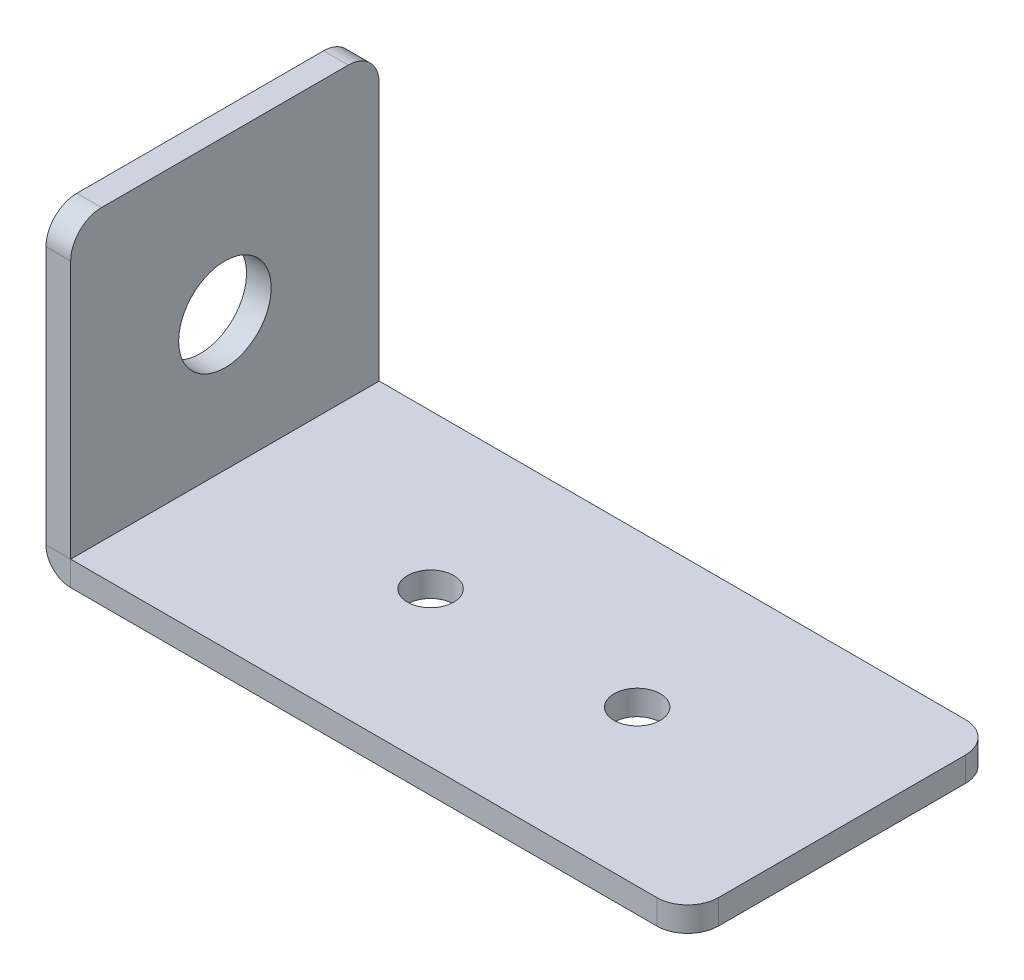
ISO-10303-21;
HEADER;
FILE_DESCRIPTION(('STEP AP214'),'2;1');
FILE_NAME('part.step','',(''),(''),'','','');
FILE_SCHEMA(('AUTOMOTIVE_DESIGN { 1 0 10303 214 1 1 1 1 }'));
ENDSEC;
DATA;
#1=APPLICATION_CONTEXT('core data for automotive mechanical design processes');
#2=APPLICATION_PROTOCOL_DEFINITION('international standard','automotive_design',2000,#1);
#3=PRODUCT_CONTEXT('',#1,'mechanical');
#4=PRODUCT('Part','Part','',(#3));
#5=PRODUCT_RELATED_PRODUCT_CATEGORY('part','',(#4));
#6=PRODUCT_DEFINITION_FORMATION('','',#4);
#7=PRODUCT_DEFINITION_CONTEXT('part definition',#1,'design');
#8=PRODUCT_DEFINITION('design','',#6,#7);
#9=PRODUCT_DEFINITION_SHAPE('','',#8);
#10=(LENGTH_UNIT() NAMED_UNIT(*) SI_UNIT(.MILLI.,.METRE.));
#11=(NAMED_UNIT(*) PLANE_ANGLE_UNIT() SI_UNIT($,.RADIAN.));
#12=(NAMED_UNIT(*) SI_UNIT($,.STERADIAN.) SOLID_ANGLE_UNIT());
#13=UNCERTAINTY_MEASURE_WITH_UNIT(LENGTH_MEASURE(1.E-05),#10,'distance_accuracy_value','');
#14=(GEOMETRIC_REPRESENTATION_CONTEXT(3) GLOBAL_UNCERTAINTY_ASSIGNED_CONTEXT((#13)) GLOBAL_UNIT_ASSIGNED_CONTEXT((#10,
#11,#12)) REPRESENTATION_CONTEXT('',''));
#15=CARTESIAN_POINT('',(0.,0.,0.));
#16=DIRECTION('',(0.,0.,1.));
#17=DIRECTION('',(1.,0.,0.));
#18=AXIS2_PLACEMENT_3D('',#15,#16,#17);
#19=CARTESIAN_POINT('',(-11.6009999999999,16.7427921422373,10.));
#20=DIRECTION('',(0.,0.,1.));
#21=DIRECTION('',(0.,-1.,0.));
#22=AXIS2_PLACEMENT_3D('',#19,#20,#21);
#23=PLANE('',#22);
#24=DIRECTION('',(0.,-1.,0.));
#25=VECTOR('',#24,1.);
#26=CARTESIAN_POINT('',(-11.6009999999999,16.7427921422373,10.));
#27=LINE('',#26,#25);
#28=CARTESIAN_POINT('',(-11.6009999999999,16.7427921422373,10.));
#29=VERTEX_POINT('',#28);
#30=CARTESIAN_POINT('',(-11.601,0.0010000000000062,10.));
#31=VERTEX_POINT('',#30);
#32=EDGE_CURVE('E244',#29,#31,#27,.T.);
#33=ORIENTED_EDGE('',*,*,#32,.T.);
#34=DIRECTION('',(1.,0.,0.));
#35=VECTOR('',#34,1.);
#36=CARTESIAN_POINT('',(-11.601,0.0010000000000062,10.));
#37=LINE('',#36,#35);
#38=CARTESIAN_POINT('',(-10.001,0.001000000000001,10.));
#39=VERTEX_POINT('',#38);
#40=EDGE_CURVE('E12',#31,#39,#37,.T.);
#41=ORIENTED_EDGE('',*,*,#40,.T.);
#42=DIRECTION('',(0.,-1.,0.));
#43=VECTOR('',#42,1.);
#44=CARTESIAN_POINT('',(-10.0009999999999,16.7427921422373,10.));
#45=LINE('',#44,#43);
#46=CARTESIAN_POINT('',(-10.0009999999999,16.7427921422373,10.));
#47=VERTEX_POINT('',#46);
#48=EDGE_CURVE('E60',#47,#39,#45,.T.);
#49=ORIENTED_EDGE('',*,*,#48,.F.);
#50=DIRECTION('',(1.,0.,0.));
#51=VECTOR('',#50,1.);
#52=CARTESIAN_POINT('',(-11.6009999999999,16.7427921422373,10.));
#53=LINE('',#52,#51);
#54=EDGE_CURVE('E160',#29,#47,#53,.T.);
#55=ORIENTED_EDGE('',*,*,#54,.F.);
#56=EDGE_LOOP('',(#33,#41,#49,#55));
#57=FACE_BOUND('',#56,.T.);
#58=ADVANCED_FACE('F44',(#57),#23,.T.);
#59=CARTESIAN_POINT('',(-11.6009999999999,16.7427921422373,-10.));
#60=DIRECTION('',(0.,0.,-1.));
#61=DIRECTION('',(0.,1.,0.));
#62=AXIS2_PLACEMENT_3D('',#59,#60,#61);
#63=PLANE('',#62);
#64=DIRECTION('',(0.,1.,0.));
#65=VECTOR('',#64,1.);
#66=CARTESIAN_POINT('',(-10.0009999999999,16.7427921422373,-10.));
#67=LINE('',#66,#65);
#68=CARTESIAN_POINT('',(-10.001,0.001000000000001,-10.));
#69=VERTEX_POINT('',#68);
#70=CARTESIAN_POINT('',(-10.0009999999999,16.7427921422373,-10.));
#71=VERTEX_POINT('',#70);
#72=EDGE_CURVE('E67',#69,#71,#67,.T.);
#73=ORIENTED_EDGE('',*,*,#72,.F.);
#74=DIRECTION('',(-1.,0.,0.));
#75=VECTOR('',#74,1.);
#76=CARTESIAN_POINT('',(-11.601,0.0010000000000062,-10.));
#77=LINE('',#76,#75);
#78=CARTESIAN_POINT('',(-11.601,0.00100000000001423,-9.99999999999999));
#79=VERTEX_POINT('',#78);
#80=EDGE_CURVE('E132',#69,#79,#77,.T.);
#81=ORIENTED_EDGE('',*,*,#80,.T.);
#82=DIRECTION('',(0.,1.,0.));
#83=VECTOR('',#82,1.);
#84=CARTESIAN_POINT('',(-11.6009999999999,16.7427921422373,-10.));
#85=LINE('',#84,#83);
#86=CARTESIAN_POINT('',(-11.6009999999999,16.7427921422373,-10.));
#87=VERTEX_POINT('',#86);
#88=EDGE_CURVE('E47',#79,#87,#85,.T.);
#89=ORIENTED_EDGE('',*,*,#88,.T.);
#90=DIRECTION('',(1.,0.,0.));
#91=VECTOR('',#90,1.);
#92=CARTESIAN_POINT('',(-11.6009999999999,16.7427921422373,-10.));
#93=LINE('',#92,#91);
#94=EDGE_CURVE('E258',#87,#71,#93,.T.);
#95=ORIENTED_EDGE('',*,*,#94,.T.);
#96=EDGE_LOOP('',(#73,#81,#89,#95));
#97=FACE_BOUND('',#96,.T.);
#98=ADVANCED_FACE('F134',(#97),#63,.T.);
#99=CARTESIAN_POINT('',(-10.0010000000001,-39.2572078577627,8.));
#100=DIRECTION('',(1.,0.,0.));
#101=DIRECTION('',(0.,0.,1.));
#102=AXIS2_PLACEMENT_3D('',#99,#100,#101);
#103=PLANE('',#102);
#104=CARTESIAN_POINT('',(-10.001,8.74279214223729,0.));
#105=DIRECTION('',(1.,0.,0.));
#106=DIRECTION('',(0.,0.,1.));
#107=AXIS2_PLACEMENT_3D('',#104,#105,#106);
#108=CIRCLE('',#107,3.);
#109=CARTESIAN_POINT('',(-10.001,8.74279214223729,3.));
#110=VERTEX_POINT('',#109);
#111=EDGE_CURVE('E181',#110,#110,#108,.T.);
#112=ORIENTED_EDGE('',*,*,#111,.F.);
#113=EDGE_LOOP('',(#112));
#114=FACE_BOUND('',#113,.T.);
#115=ORIENTED_EDGE('',*,*,#48,.T.);
#116=DIRECTION('',(0.,0.,-1.));
#117=VECTOR('',#116,1.);
#118=CARTESIAN_POINT('',(-10.001,0.001000000000001,8.));
#119=LINE('',#118,#117);
#120=EDGE_CURVE('E52',#39,#69,#119,.T.);
#121=ORIENTED_EDGE('',*,*,#120,.T.);
#122=ORIENTED_EDGE('',*,*,#72,.T.);
#123=CARTESIAN_POINT('',(-10.0009999999999,16.7427921422373,-8.));
#124=DIRECTION('',(1.,0.,0.));
#125=DIRECTION('',(0.,0.,-1.));
#126=AXIS2_PLACEMENT_3D('',#123,#124,#125);
#127=CIRCLE('',#126,2.);
#128=CARTESIAN_POINT('',(-10.0009999999999,18.7427921422373,-7.99999999999999));
#129=VERTEX_POINT('',#128);
#130=EDGE_CURVE('E245',#71,#129,#127,.T.);
#131=ORIENTED_EDGE('',*,*,#130,.T.);
#132=DIRECTION('',(0.,0.,1.));
#133=VECTOR('',#132,1.);
#134=CARTESIAN_POINT('',(-10.0009999999999,18.7427921422373,7.99999999999999));
#135=LINE('',#134,#133);
#136=CARTESIAN_POINT('',(-10.0009999999999,18.7427921422373,7.99999999999999));
#137=VERTEX_POINT('',#136);
#138=EDGE_CURVE('E248',#129,#137,#135,.T.);
#139=ORIENTED_EDGE('',*,*,#138,.T.);
#140=CARTESIAN_POINT('',(-10.0009999999999,16.7427921422373,8.));
#141=DIRECTION('',(1.,0.,0.));
#142=DIRECTION('',(0.,0.,-1.));
#143=AXIS2_PLACEMENT_3D('',#140,#141,#142);
#144=CIRCLE('',#143,2.);
#145=EDGE_CURVE('E251',#137,#47,#144,.T.);
#146=ORIENTED_EDGE('',*,*,#145,.T.);
#147=EDGE_LOOP('',(#115,#121,#122,#131,#139,#146));
#148=FACE_BOUND('',#147,.T.);
#149=ADVANCED_FACE('F262',(#114,#148),#103,.T.);
#150=CARTESIAN_POINT('',(-11.6009999999999,16.7427921422373,8.));
#151=DIRECTION('',(1.,0.,0.));
#152=DIRECTION('',(0.,0.,1.));
#153=AXIS2_PLACEMENT_3D('',#150,#151,#152);
#154=CYLINDRICAL_SURFACE('',#153,2.);
#155=ORIENTED_EDGE('',*,*,#145,.F.);
#156=DIRECTION('',(1.,0.,0.));
#157=VECTOR('',#156,1.);
#158=CARTESIAN_POINT('',(-11.6009999999999,18.7427921422373,7.99999999999999));
#159=LINE('',#158,#157);
#160=CARTESIAN_POINT('',(-11.6009999999999,18.7427921422373,7.99999999999999));
#161=VERTEX_POINT('',#160);
#162=EDGE_CURVE('E254',#161,#137,#159,.T.);
#163=ORIENTED_EDGE('',*,*,#162,.F.);
#164=CARTESIAN_POINT('',(-11.6009999999999,16.7427921422373,8.));
#165=DIRECTION('',(1.,0.,0.));
#166=DIRECTION('',(0.,0.,-1.));
#167=AXIS2_PLACEMENT_3D('',#164,#165,#166);
#168=CIRCLE('',#167,2.);
#169=EDGE_CURVE('E241',#161,#29,#168,.T.);
#170=ORIENTED_EDGE('',*,*,#169,.T.);
#171=ORIENTED_EDGE('',*,*,#54,.T.);
#172=EDGE_LOOP('',(#155,#163,#170,#171));
#173=FACE_BOUND('',#172,.T.);
#174=ADVANCED_FACE('F324',(#173),#154,.T.);
#175=CARTESIAN_POINT('',(-11.6009999999999,18.7427921422373,7.99999999999999));
#176=DIRECTION('',(0.,1.,0.));
#177=DIRECTION('',(0.,0.,1.));
#178=AXIS2_PLACEMENT_3D('',#175,#176,#177);
#179=PLANE('',#178);
#180=ORIENTED_EDGE('',*,*,#138,.F.);
#181=DIRECTION('',(1.,0.,0.));
#182=VECTOR('',#181,1.);
#183=CARTESIAN_POINT('',(-11.6009999999999,18.7427921422373,-7.99999999999999));
#184=LINE('',#183,#182);
#185=CARTESIAN_POINT('',(-11.6009999999999,18.7427921422373,-7.99999999999999));
#186=VERTEX_POINT('',#185);
#187=EDGE_CURVE('E256',#186,#129,#184,.T.);
#188=ORIENTED_EDGE('',*,*,#187,.F.);
#189=DIRECTION('',(0.,0.,1.));
#190=VECTOR('',#189,1.);
#191=CARTESIAN_POINT('',(-11.6009999999999,18.7427921422373,7.99999999999999));
#192=LINE('',#191,#190);
#193=EDGE_CURVE('E238',#186,#161,#192,.T.);
#194=ORIENTED_EDGE('',*,*,#193,.T.);
#195=ORIENTED_EDGE('',*,*,#162,.T.);
#196=EDGE_LOOP('',(#180,#188,#194,#195));
#197=FACE_BOUND('',#196,.T.);
#198=ADVANCED_FACE('F269',(#197),#179,.T.);
#199=CARTESIAN_POINT('',(-11.6009999999999,16.7427921422373,-8.));
#200=DIRECTION('',(1.,0.,0.));
#201=DIRECTION('',(0.,0.,1.));
#202=AXIS2_PLACEMENT_3D('',#199,#200,#201);
#203=CYLINDRICAL_SURFACE('',#202,2.);
#204=ORIENTED_EDGE('',*,*,#130,.F.);
#205=ORIENTED_EDGE('',*,*,#94,.F.);
#206=CARTESIAN_POINT('',(-11.6009999999999,16.7427921422373,-8.));
#207=DIRECTION('',(1.,0.,0.));
#208=DIRECTION('',(0.,0.,-1.));
#209=AXIS2_PLACEMENT_3D('',#206,#207,#208);
#210=CIRCLE('',#209,2.);
#211=EDGE_CURVE('E151',#87,#186,#210,.T.);
#212=ORIENTED_EDGE('',*,*,#211,.T.);
#213=ORIENTED_EDGE('',*,*,#187,.T.);
#214=EDGE_LOOP('',(#204,#205,#212,#213));
#215=FACE_BOUND('',#214,.T.);
#216=ADVANCED_FACE('F266',(#215),#203,.T.);
#217=CARTESIAN_POINT('',(-11.6010000000001,-39.2572078577627,8.));
#218=DIRECTION('',(1.,0.,0.));
#219=DIRECTION('',(0.,0.,1.));
#220=AXIS2_PLACEMENT_3D('',#217,#218,#219);
#221=PLANE('',#220);
#222=DIRECTION('',(0.,0.,-1.));
#223=VECTOR('',#222,1.);
#224=CARTESIAN_POINT('',(-11.601,0.0010000000000062,8.));
#225=LINE('',#224,#223);
#226=EDGE_CURVE('E140',#31,#79,#225,.T.);
#227=ORIENTED_EDGE('',*,*,#226,.F.);
#228=ORIENTED_EDGE('',*,*,#32,.F.);
#229=ORIENTED_EDGE('',*,*,#169,.F.);
#230=ORIENTED_EDGE('',*,*,#193,.F.);
#231=ORIENTED_EDGE('',*,*,#211,.F.);
#232=ORIENTED_EDGE('',*,*,#88,.F.);
#233=EDGE_LOOP('',(#227,#228,#229,#230,#231,#232));
#234=FACE_BOUND('',#233,.T.);
#235=CARTESIAN_POINT('',(-11.601,8.74279214223729,0.));
#236=DIRECTION('',(1.,0.,0.));
#237=DIRECTION('',(0.,0.,1.));
#238=AXIS2_PLACEMENT_3D('',#235,#236,#237);
#239=CIRCLE('',#238,3.);
#240=CARTESIAN_POINT('',(-11.601,8.74279214223729,3.));
#241=VERTEX_POINT('',#240);
#242=EDGE_CURVE('E232',#241,#241,#239,.T.);
#243=ORIENTED_EDGE('',*,*,#242,.T.);
#244=EDGE_LOOP('',(#243));
#245=FACE_BOUND('',#244,.T.);
#246=ADVANCED_FACE('F145',(#234,#245),#221,.F.);
#247=CARTESIAN_POINT('',(-11.601,8.74279214223729,0.));
#248=DIRECTION('',(1.,0.,0.));
#249=DIRECTION('',(0.,0.,1.));
#250=AXIS2_PLACEMENT_3D('',#247,#248,#249);
#251=CYLINDRICAL_SURFACE('',#250,3.);
#252=ORIENTED_EDGE('',*,*,#242,.F.);
#253=EDGE_LOOP('',(#252));
#254=FACE_BOUND('',#253,.T.);
#255=ORIENTED_EDGE('',*,*,#111,.T.);
#256=EDGE_LOOP('',(#255));
#257=FACE_BOUND('',#256,.T.);
#258=ADVANCED_FACE('F329',(#254,#257),#251,.F.);
#259=CARTESIAN_POINT('',(28.,-1.6,8.));
#260=DIRECTION('',(0.,1.,0.));
#261=DIRECTION('',(0.,0.,1.));
#262=AXIS2_PLACEMENT_3D('',#259,#260,#261);
#263=CYLINDRICAL_SURFACE('',#262,2.);
#264=CARTESIAN_POINT('',(28.,0.,8.));
#265=DIRECTION('',(0.,1.,0.));
#266=DIRECTION('',(0.,0.,1.));
#267=AXIS2_PLACEMENT_3D('',#264,#265,#266);
#268=CIRCLE('',#267,2.);
#269=CARTESIAN_POINT('',(28.,0.,10.));
#270=VERTEX_POINT('',#269);
#271=CARTESIAN_POINT('',(30.,0.,7.99999999999999));
#272=VERTEX_POINT('',#271);
#273=EDGE_CURVE('E192',#270,#272,#268,.T.);
#274=ORIENTED_EDGE('',*,*,#273,.F.);
#275=DIRECTION('',(0.,1.,0.));
#276=VECTOR('',#275,1.);
#277=CARTESIAN_POINT('',(28.,-1.6,10.));
#278=LINE('',#277,#276);
#279=CARTESIAN_POINT('',(28.,-1.6,10.));
#280=VERTEX_POINT('',#279);
#281=EDGE_CURVE('E178',#280,#270,#278,.T.);
#282=ORIENTED_EDGE('',*,*,#281,.F.);
#283=CARTESIAN_POINT('',(28.,-1.6,8.));
#284=DIRECTION('',(0.,1.,0.));
#285=DIRECTION('',(0.,0.,1.));
#286=AXIS2_PLACEMENT_3D('',#283,#284,#285);
#287=CIRCLE('',#286,2.);
#288=CARTESIAN_POINT('',(30.,-1.6,7.99999999999999));
#289=VERTEX_POINT('',#288);
#290=EDGE_CURVE('E226',#280,#289,#287,.T.);
#291=ORIENTED_EDGE('',*,*,#290,.T.);
#292=DIRECTION('',(0.,1.,0.));
#293=VECTOR('',#292,1.);
#294=CARTESIAN_POINT('',(30.,-1.6,7.99999999999999));
#295=LINE('',#294,#293);
#296=EDGE_CURVE('E224',#289,#272,#295,.T.);
#297=ORIENTED_EDGE('',*,*,#296,.T.);
#298=EDGE_LOOP('',(#274,#282,#291,#297));
#299=FACE_BOUND('',#298,.T.);
#300=ADVANCED_FACE('F299',(#299),#263,.T.);
#301=CARTESIAN_POINT('',(30.,-1.6,7.99999999999999));
#302=DIRECTION('',(1.,0.,0.));
#303=DIRECTION('',(0.,0.,-1.));
#304=AXIS2_PLACEMENT_3D('',#301,#302,#303);
#305=PLANE('',#304);
#306=DIRECTION('',(0.,0.,-1.));
#307=VECTOR('',#306,1.);
#308=CARTESIAN_POINT('',(30.,0.,7.99999999999999));
#309=LINE('',#308,#307);
#310=CARTESIAN_POINT('',(30.,0.,-7.99999999999999));
#311=VERTEX_POINT('',#310);
#312=EDGE_CURVE('E189',#272,#311,#309,.T.);
#313=ORIENTED_EDGE('',*,*,#312,.F.);
#314=ORIENTED_EDGE('',*,*,#296,.F.);
#315=DIRECTION('',(0.,0.,-1.));
#316=VECTOR('',#315,1.);
#317=CARTESIAN_POINT('',(30.,-1.6,7.99999999999999));
#318=LINE('',#317,#316);
#319=CARTESIAN_POINT('',(30.,-1.6,-7.99999999999999));
#320=VERTEX_POINT('',#319);
#321=EDGE_CURVE('E221',#289,#320,#318,.T.);
#322=ORIENTED_EDGE('',*,*,#321,.T.);
#323=DIRECTION('',(0.,1.,0.));
#324=VECTOR('',#323,1.);
#325=CARTESIAN_POINT('',(30.,-1.6,-7.99999999999999));
#326=LINE('',#325,#324);
#327=EDGE_CURVE('E219',#320,#311,#326,.T.);
#328=ORIENTED_EDGE('',*,*,#327,.T.);
#329=EDGE_LOOP('',(#313,#314,#322,#328));
#330=FACE_BOUND('',#329,.T.);
#331=ADVANCED_FACE('F302',(#330),#305,.T.);
#332=CARTESIAN_POINT('',(28.,-1.6,-8.));
#333=DIRECTION('',(0.,1.,0.));
#334=DIRECTION('',(0.,0.,1.));
#335=AXIS2_PLACEMENT_3D('',#332,#333,#334);
#336=CYLINDRICAL_SURFACE('',#335,2.);
#337=CARTESIAN_POINT('',(28.,0.,-8.));
#338=DIRECTION('',(0.,1.,0.));
#339=DIRECTION('',(0.,0.,-1.));
#340=AXIS2_PLACEMENT_3D('',#337,#338,#339);
#341=CIRCLE('',#340,2.);
#342=CARTESIAN_POINT('',(28.,0.,-10.));
#343=VERTEX_POINT('',#342);
#344=EDGE_CURVE('E186',#311,#343,#341,.T.);
#345=ORIENTED_EDGE('',*,*,#344,.F.);
#346=ORIENTED_EDGE('',*,*,#327,.F.);
#347=CARTESIAN_POINT('',(28.,-1.6,-8.));
#348=DIRECTION('',(0.,1.,0.));
#349=DIRECTION('',(0.,0.,-1.));
#350=AXIS2_PLACEMENT_3D('',#347,#348,#349);
#351=CIRCLE('',#350,2.);
#352=CARTESIAN_POINT('',(28.,-1.6,-10.));
#353=VERTEX_POINT('',#352);
#354=EDGE_CURVE('E216',#320,#353,#351,.T.);
#355=ORIENTED_EDGE('',*,*,#354,.T.);
#356=DIRECTION('',(0.,1.,0.));
#357=VECTOR('',#356,1.);
#358=CARTESIAN_POINT('',(28.,-1.6,-10.));
#359=LINE('',#358,#357);
#360=EDGE_CURVE('E214',#353,#343,#359,.T.);
#361=ORIENTED_EDGE('',*,*,#360,.T.);
#362=EDGE_LOOP('',(#345,#346,#355,#361));
#363=FACE_BOUND('',#362,.T.);
#364=ADVANCED_FACE('F304',(#363),#336,.T.);
#365=CARTESIAN_POINT('',(3.33333333333334,-1.6,0.));
#366=DIRECTION('',(0.,1.,0.));
#367=DIRECTION('',(0.,0.,1.));
#368=AXIS2_PLACEMENT_3D('',#365,#366,#367);
#369=CYLINDRICAL_SURFACE('',#368,1.5);
#370=CARTESIAN_POINT('',(3.33333333333334,-1.6,0.));
#371=DIRECTION('',(0.,1.,0.));
#372=DIRECTION('',(0.,0.,1.));
#373=AXIS2_PLACEMENT_3D('',#370,#371,#372);
#374=CIRCLE('',#373,1.5);
#375=CARTESIAN_POINT('',(3.33333333333334,-1.6,1.5));
#376=VERTEX_POINT('',#375);
#377=EDGE_CURVE('E202',#376,#376,#374,.T.);
#378=ORIENTED_EDGE('',*,*,#377,.F.);
#379=EDGE_LOOP('',(#378));
#380=FACE_BOUND('',#379,.T.);
#381=CARTESIAN_POINT('',(3.33333333333334,0.,0.));
#382=DIRECTION('',(0.,1.,0.));
#383=DIRECTION('',(0.,0.,1.));
#384=AXIS2_PLACEMENT_3D('',#381,#382,#383);
#385=CIRCLE('',#384,1.5);
#386=CARTESIAN_POINT('',(3.33333333333334,0.,1.5));
#387=VERTEX_POINT('',#386);
#388=EDGE_CURVE('E211',#387,#387,#385,.T.);
#389=ORIENTED_EDGE('',*,*,#388,.T.);
#390=EDGE_LOOP('',(#389));
#391=FACE_BOUND('',#390,.T.);
#392=ADVANCED_FACE('F306',(#380,#391),#369,.F.);
#393=CARTESIAN_POINT('',(16.6666666666667,-1.6,-0.059373733636106));
#394=DIRECTION('',(0.,1.,0.));
#395=DIRECTION('',(0.,0.,1.));
#396=AXIS2_PLACEMENT_3D('',#393,#394,#395);
#397=CYLINDRICAL_SURFACE('',#396,1.5);
#398=CARTESIAN_POINT('',(16.6666666666667,-1.6,-0.059373733636106));
#399=DIRECTION('',(0.,1.,0.));
#400=DIRECTION('',(0.,0.,1.));
#401=AXIS2_PLACEMENT_3D('',#398,#399,#400);
#402=CIRCLE('',#401,1.5);
#403=CARTESIAN_POINT('',(16.6666666666667,-1.6,1.44062626636389));
#404=VERTEX_POINT('',#403);
#405=EDGE_CURVE('E205',#404,#404,#402,.T.);
#406=ORIENTED_EDGE('',*,*,#405,.F.);
#407=EDGE_LOOP('',(#406));
#408=FACE_BOUND('',#407,.T.);
#409=CARTESIAN_POINT('',(16.6666666666667,0.,-0.059373733636106));
#410=DIRECTION('',(0.,1.,0.));
#411=DIRECTION('',(0.,0.,1.));
#412=AXIS2_PLACEMENT_3D('',#409,#410,#411);
#413=CIRCLE('',#412,1.5);
#414=CARTESIAN_POINT('',(16.6666666666667,0.,1.44062626636389));
#415=VERTEX_POINT('',#414);
#416=EDGE_CURVE('E208',#415,#415,#413,.T.);
#417=ORIENTED_EDGE('',*,*,#416,.T.);
#418=EDGE_LOOP('',(#417));
#419=FACE_BOUND('',#418,.T.);
#420=ADVANCED_FACE('F312',(#408,#419),#397,.F.);
#421=CARTESIAN_POINT('',(28.,-1.6,8.));
#422=DIRECTION('',(0.,1.,0.));
#423=DIRECTION('',(0.,0.,1.));
#424=AXIS2_PLACEMENT_3D('',#421,#422,#423);
#425=PLANE('',#424);
#426=ORIENTED_EDGE('',*,*,#405,.T.);
#427=EDGE_LOOP('',(#426));
#428=FACE_BOUND('',#427,.T.);
#429=ORIENTED_EDGE('',*,*,#377,.T.);
#430=EDGE_LOOP('',(#429));
#431=FACE_BOUND('',#430,.T.);
#432=DIRECTION('',(1.,0.,0.));
#433=VECTOR('',#432,1.);
#434=CARTESIAN_POINT('',(-28.,-1.6,10.));
#435=LINE('',#434,#433);
#436=CARTESIAN_POINT('',(-9.99999999999998,-1.6,10.));
#437=VERTEX_POINT('',#436);
#438=EDGE_CURVE('E182',#437,#280,#435,.T.);
#439=ORIENTED_EDGE('',*,*,#438,.F.);
#440=DIRECTION('',(0.,0.,-1.));
#441=VECTOR('',#440,1.);
#442=CARTESIAN_POINT('',(-9.99999999999998,-1.6,8.));
#443=LINE('',#442,#441);
#444=CARTESIAN_POINT('',(-9.99999999999998,-1.6,-9.99999999999999));
#445=VERTEX_POINT('',#444);
#446=EDGE_CURVE('E199',#437,#445,#443,.T.);
#447=ORIENTED_EDGE('',*,*,#446,.T.);
#448=DIRECTION('',(-1.,0.,0.));
#449=VECTOR('',#448,1.);
#450=CARTESIAN_POINT('',(-28.,-1.6,-10.));
#451=LINE('',#450,#449);
#452=EDGE_CURVE('E197',#353,#445,#451,.T.);
#453=ORIENTED_EDGE('',*,*,#452,.F.);
#454=ORIENTED_EDGE('',*,*,#354,.F.);
#455=ORIENTED_EDGE('',*,*,#321,.F.);
#456=ORIENTED_EDGE('',*,*,#290,.F.);
#457=EDGE_LOOP('',(#439,#447,#453,#454,#455,#456));
#458=FACE_BOUND('',#457,.T.);
#459=ADVANCED_FACE('F295',(#428,#431,#458),#425,.F.);
#460=CARTESIAN_POINT('',(-28.,-1.6,-10.));
#461=DIRECTION('',(0.,0.,-1.));
#462=DIRECTION('',(-1.,0.,0.));
#463=AXIS2_PLACEMENT_3D('',#460,#461,#462);
#464=PLANE('',#463);
#465=DIRECTION('',(0.,-1.,0.));
#466=VECTOR('',#465,1.);
#467=CARTESIAN_POINT('',(-9.99999999999999,-1.6,-10.));
#468=LINE('',#467,#466);
#469=CARTESIAN_POINT('',(-9.99999999999998,0.,-10.));
#470=VERTEX_POINT('',#469);
#471=EDGE_CURVE('E165',#470,#445,#468,.T.);
#472=ORIENTED_EDGE('',*,*,#471,.F.);
#473=DIRECTION('',(-1.,0.,0.));
#474=VECTOR('',#473,1.);
#475=CARTESIAN_POINT('',(-28.,0.,-10.));
#476=LINE('',#475,#474);
#477=EDGE_CURVE('E184',#343,#470,#476,.T.);
#478=ORIENTED_EDGE('',*,*,#477,.F.);
#479=ORIENTED_EDGE('',*,*,#360,.F.);
#480=ORIENTED_EDGE('',*,*,#452,.T.);
#481=EDGE_LOOP('',(#472,#478,#479,#480));
#482=FACE_BOUND('',#481,.T.);
#483=ADVANCED_FACE('F291',(#482),#464,.T.);
#484=CARTESIAN_POINT('',(28.,0.,8.));
#485=DIRECTION('',(0.,1.,0.));
#486=DIRECTION('',(0.,0.,1.));
#487=AXIS2_PLACEMENT_3D('',#484,#485,#486);
#488=PLANE('',#487);
#489=DIRECTION('',(0.,0.,-1.));
#490=VECTOR('',#489,1.);
#491=CARTESIAN_POINT('',(-9.99999999999998,0.,8.));
#492=LINE('',#491,#490);
#493=CARTESIAN_POINT('',(-9.99999999999998,0.,10.));
#494=VERTEX_POINT('',#493);
#495=EDGE_CURVE('E169',#494,#470,#492,.T.);
#496=ORIENTED_EDGE('',*,*,#495,.F.);
#497=DIRECTION('',(1.,0.,0.));
#498=VECTOR('',#497,1.);
#499=CARTESIAN_POINT('',(-28.,0.,10.));
#500=LINE('',#499,#498);
#501=EDGE_CURVE('E195',#494,#270,#500,.T.);
#502=ORIENTED_EDGE('',*,*,#501,.T.);
#503=ORIENTED_EDGE('',*,*,#273,.T.);
#504=ORIENTED_EDGE('',*,*,#312,.T.);
#505=ORIENTED_EDGE('',*,*,#344,.T.);
#506=ORIENTED_EDGE('',*,*,#477,.T.);
#507=EDGE_LOOP('',(#496,#502,#503,#504,#505,#506));
#508=FACE_BOUND('',#507,.T.);
#509=ORIENTED_EDGE('',*,*,#388,.F.);
#510=EDGE_LOOP('',(#509));
#511=FACE_BOUND('',#510,.T.);
#512=ORIENTED_EDGE('',*,*,#416,.F.);
#513=EDGE_LOOP('',(#512));
#514=FACE_BOUND('',#513,.T.);
#515=ADVANCED_FACE('F286',(#508,#511,#514),#488,.T.);
#516=CARTESIAN_POINT('',(-28.,-1.6,10.));
#517=DIRECTION('',(0.,0.,1.));
#518=DIRECTION('',(1.,0.,0.));
#519=AXIS2_PLACEMENT_3D('',#516,#517,#518);
#520=PLANE('',#519);
#521=DIRECTION('',(0.,1.,0.));
#522=VECTOR('',#521,1.);
#523=CARTESIAN_POINT('',(-9.99999999999999,-1.6,10.));
#524=LINE('',#523,#522);
#525=EDGE_CURVE('E166',#437,#494,#524,.T.);
#526=ORIENTED_EDGE('',*,*,#525,.F.);
#527=ORIENTED_EDGE('',*,*,#438,.T.);
#528=ORIENTED_EDGE('',*,*,#281,.T.);
#529=ORIENTED_EDGE('',*,*,#501,.F.);
#530=EDGE_LOOP('',(#526,#527,#528,#529));
#531=FACE_BOUND('',#530,.T.);
#532=ADVANCED_FACE('F281',(#531),#520,.T.);
#533=CARTESIAN_POINT('',(-9.99999999999998,0.000999999999999916,10.));
#534=DIRECTION('',(0.,0.,1.));
#535=DIRECTION('',(1.,0.,0.));
#536=AXIS2_PLACEMENT_3D('',#533,#534,#535);
#537=PLANE('',#536);
#538=ORIENTED_EDGE('',*,*,#525,.T.);
#539=CARTESIAN_POINT('',(-9.99999999999998,0.000999999999999916,10.));
#540=DIRECTION('',(0.,0.,-1.));
#541=DIRECTION('',(-1.,0.,0.));
#542=AXIS2_PLACEMENT_3D('',#539,#540,#541);
#543=CIRCLE('',#542,0.000999999999999916);
#544=EDGE_CURVE('E175',#494,#39,#543,.T.);
#545=ORIENTED_EDGE('',*,*,#544,.T.);
#546=ORIENTED_EDGE('',*,*,#40,.F.);
#547=CARTESIAN_POINT('',(-9.99999999999998,0.000999999999999916,10.));
#548=DIRECTION('',(0.,0.,-1.));
#549=DIRECTION('',(1.,0.,0.));
#550=AXIS2_PLACEMENT_3D('',#547,#548,#549);
#551=CIRCLE('',#550,1.601);
#552=EDGE_CURVE('E159',#437,#31,#551,.T.);
#553=ORIENTED_EDGE('',*,*,#552,.F.);
#554=EDGE_LOOP('',(#538,#545,#546,#553));
#555=FACE_BOUND('',#554,.T.);
#556=ADVANCED_FACE('F278',(#555),#537,.T.);
#557=CARTESIAN_POINT('',(-9.99999999999998,0.000999999999999916,-9.99999999999999));
#558=DIRECTION('',(0.,0.,-1.));
#559=DIRECTION('',(-1.,0.,0.));
#560=AXIS2_PLACEMENT_3D('',#557,#558,#559);
#561=PLANE('',#560);
#562=ORIENTED_EDGE('',*,*,#80,.F.);
#563=CARTESIAN_POINT('',(-9.99999999999998,0.000999999999999916,-9.99999999999999));
#564=DIRECTION('',(0.,0.,-1.));
#565=DIRECTION('',(-1.,0.,0.));
#566=AXIS2_PLACEMENT_3D('',#563,#564,#565);
#567=CIRCLE('',#566,0.000999999999999916);
#568=EDGE_CURVE('E171',#69,#470,#567,.F.);
#569=ORIENTED_EDGE('',*,*,#568,.T.);
#570=ORIENTED_EDGE('',*,*,#471,.T.);
#571=CARTESIAN_POINT('',(-9.99999999999998,0.000999999999999916,-9.99999999999999));
#572=DIRECTION('',(0.,0.,1.));
#573=DIRECTION('',(-1.,0.,0.));
#574=AXIS2_PLACEMENT_3D('',#571,#572,#573);
#575=CIRCLE('',#574,1.601);
#576=EDGE_CURVE('E157',#79,#445,#575,.T.);
#577=ORIENTED_EDGE('',*,*,#576,.F.);
#578=EDGE_LOOP('',(#562,#569,#570,#577));
#579=FACE_BOUND('',#578,.T.);
#580=ADVANCED_FACE('F163',(#579),#561,.T.);
#581=CARTESIAN_POINT('',(-9.99999999999998,0.000999999999999916,20.1033103496249));
#582=DIRECTION('',(0.,0.,-1.));
#583=DIRECTION('',(-1.,0.,0.));
#584=AXIS2_PLACEMENT_3D('',#581,#582,#583);
#585=CYLINDRICAL_SURFACE('',#584,1.601);
#586=ORIENTED_EDGE('',*,*,#576,.T.);
#587=ORIENTED_EDGE('',*,*,#446,.F.);
#588=ORIENTED_EDGE('',*,*,#552,.T.);
#589=ORIENTED_EDGE('',*,*,#226,.T.);
#590=EDGE_LOOP('',(#586,#587,#588,#589));
#591=FACE_BOUND('',#590,.T.);
#592=ADVANCED_FACE('F155',(#591),#585,.T.);
#593=CARTESIAN_POINT('',(-9.99999999999998,0.000999999999999916,20.1033103496249));
#594=DIRECTION('',(0.,0.,-1.));
#595=DIRECTION('',(-1.,0.,0.));
#596=AXIS2_PLACEMENT_3D('',#593,#594,#595);
#597=CYLINDRICAL_SURFACE('',#596,0.000999999999999916);
#598=ORIENTED_EDGE('',*,*,#568,.F.);
#599=ORIENTED_EDGE('',*,*,#120,.F.);
#600=ORIENTED_EDGE('',*,*,#544,.F.);
#601=ORIENTED_EDGE('',*,*,#495,.T.);
#602=EDGE_LOOP('',(#598,#599,#600,#601));
#603=FACE_BOUND('',#602,.T.);
#604=ADVANCED_FACE('F277',(#603),#597,.F.);
#605=CLOSED_SHELL('',(#58,#98,#149,#174,#198,#216,#246,#258,#300,#331,#364,#392,#420,#459,#483,
#515,#532,#556,#580,#592,#604));
#606=MANIFOLD_SOLID_BREP('B2',#605);
#607=ADVANCED_BREP_SHAPE_REPRESENTATION('',(#18,#606),#14);
#608=SHAPE_DEFINITION_REPRESENTATION(#9,#607);
ENDSEC;
END-ISO-10303-21;
